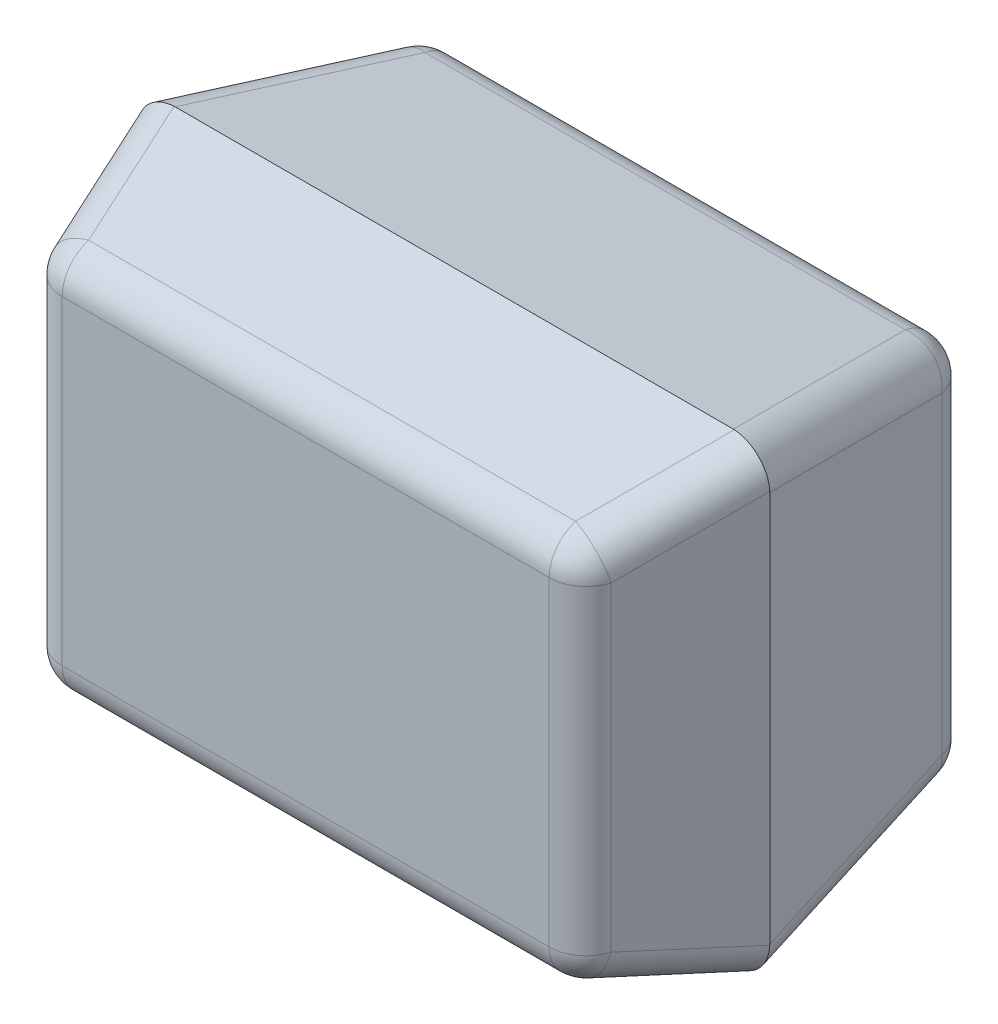
ISO-10303-21;
HEADER;
FILE_DESCRIPTION(('STEP AP214'),'2;1');
FILE_NAME('part.step','',(''),(''),'','','');
FILE_SCHEMA(('AUTOMOTIVE_DESIGN { 1 0 10303 214 1 1 1 1 }'));
ENDSEC;
DATA;
#1=APPLICATION_CONTEXT('core data for automotive mechanical design processes');
#2=APPLICATION_PROTOCOL_DEFINITION('international standard','automotive_design',2000,#1);
#3=PRODUCT_CONTEXT('',#1,'mechanical');
#4=PRODUCT('Part','Part','',(#3));
#5=PRODUCT_RELATED_PRODUCT_CATEGORY('part','',(#4));
#6=PRODUCT_DEFINITION_FORMATION('','',#4);
#7=PRODUCT_DEFINITION_CONTEXT('part definition',#1,'design');
#8=PRODUCT_DEFINITION('design','',#6,#7);
#9=PRODUCT_DEFINITION_SHAPE('','',#8);
#10=(LENGTH_UNIT() NAMED_UNIT(*) SI_UNIT(.MILLI.,.METRE.));
#11=(NAMED_UNIT(*) PLANE_ANGLE_UNIT() SI_UNIT($,.RADIAN.));
#12=(NAMED_UNIT(*) SI_UNIT($,.STERADIAN.) SOLID_ANGLE_UNIT());
#13=UNCERTAINTY_MEASURE_WITH_UNIT(LENGTH_MEASURE(1.E-05),#10,'distance_accuracy_value','');
#14=(GEOMETRIC_REPRESENTATION_CONTEXT(3) GLOBAL_UNCERTAINTY_ASSIGNED_CONTEXT((#13)) GLOBAL_UNIT_ASSIGNED_CONTEXT((#10,
#11,#12)) REPRESENTATION_CONTEXT('',''));
#15=CARTESIAN_POINT('',(0.,0.,0.));
#16=DIRECTION('',(0.,0.,1.));
#17=DIRECTION('',(1.,0.,0.));
#18=AXIS2_PLACEMENT_3D('',#15,#16,#17);
#19=CARTESIAN_POINT('',(0.,0.,0.));
#20=DIRECTION('',(0.,0.,1.));
#21=DIRECTION('',(1.,0.,0.));
#22=AXIS2_PLACEMENT_3D('',#19,#20,#21);
#23=PLANE('',#22);
#24=DIRECTION('',(0.,-1.,0.));
#25=VECTOR('',#24,1.);
#26=CARTESIAN_POINT('',(-0.646771674648,0.15625,0.));
#27=LINE('',#26,#25);
#28=CARTESIAN_POINT('',(-0.646771674648,0.421771674648,0.));
#29=VERTEX_POINT('',#28);
#30=CARTESIAN_POINT('',(-0.646771674648,-0.421771674648,0.));
#31=VERTEX_POINT('',#30);
#32=EDGE_CURVE('E265',#29,#31,#27,.T.);
#33=ORIENTED_EDGE('',*,*,#32,.F.);
#34=DIRECTION('',(-1.,0.,0.));
#35=VECTOR('',#34,1.);
#36=CARTESIAN_POINT('',(0.2125,0.421771674648,0.));
#37=LINE('',#36,#35);
#38=CARTESIAN_POINT('',(0.646771674648,0.421771674648,0.));
#39=VERTEX_POINT('',#38);
#40=EDGE_CURVE('E173',#39,#29,#37,.T.);
#41=ORIENTED_EDGE('',*,*,#40,.F.);
#42=DIRECTION('',(0.,1.,0.));
#43=VECTOR('',#42,1.);
#44=CARTESIAN_POINT('',(0.646771674648,-0.15625,0.));
#45=LINE('',#44,#43);
#46=CARTESIAN_POINT('',(0.646771674648,-0.421771674648,0.));
#47=VERTEX_POINT('',#46);
#48=EDGE_CURVE('E255',#47,#39,#45,.T.);
#49=ORIENTED_EDGE('',*,*,#48,.F.);
#50=DIRECTION('',(1.,0.,0.));
#51=VECTOR('',#50,1.);
#52=CARTESIAN_POINT('',(-0.2125,-0.421771674648,0.));
#53=LINE('',#52,#51);
#54=EDGE_CURVE('E261',#31,#47,#53,.T.);
#55=ORIENTED_EDGE('',*,*,#54,.F.);
#56=EDGE_LOOP('',(#33,#41,#49,#55));
#57=FACE_BOUND('',#56,.T.);
#58=ADVANCED_FACE('F17',(#57),#23,.F.);
#59=CARTESIAN_POINT('',(0.2125,0.421771674648,0.1));
#60=DIRECTION('',(-1.,0.,0.));
#61=DIRECTION('',(0.,-1.,0.));
#62=AXIS2_PLACEMENT_3D('',#59,#60,#61);
#63=CYLINDRICAL_SURFACE('',#62,0.1);
#64=CARTESIAN_POINT('',(0.646771674648,0.421771674648,0.1));
#65=DIRECTION('',(-1.,0.,0.));
#66=DIRECTION('',(0.,-1.,0.));
#67=AXIS2_PLACEMENT_3D('',#64,#65,#66);
#68=CIRCLE('',#67,0.1);
#69=CARTESIAN_POINT('',(0.646771674648,0.520109892686856,0.0818452520544166));
#70=VERTEX_POINT('',#69);
#71=EDGE_CURVE('E258',#39,#70,#68,.F.);
#72=ORIENTED_EDGE('',*,*,#71,.F.);
#73=ORIENTED_EDGE('',*,*,#40,.T.);
#74=CARTESIAN_POINT('',(-0.646771674648,0.421771674648,0.1));
#75=DIRECTION('',(-1.,0.,0.));
#76=DIRECTION('',(0.,-1.,0.));
#77=AXIS2_PLACEMENT_3D('',#74,#75,#76);
#78=CIRCLE('',#77,0.1);
#79=CARTESIAN_POINT('',(-0.646771674648072,0.52010989268686,0.0818452520544024));
#80=VERTEX_POINT('',#79);
#81=EDGE_CURVE('E20',#80,#29,#78,.T.);
#82=ORIENTED_EDGE('',*,*,#81,.F.);
#83=DIRECTION('',(1.,0.,0.));
#84=VECTOR('',#83,1.);
#85=CARTESIAN_POINT('',(0.425,0.52010989268698,0.0818452520543936));
#86=LINE('',#85,#84);
#87=EDGE_CURVE('E201',#70,#80,#86,.F.);
#88=ORIENTED_EDGE('',*,*,#87,.F.);
#89=EDGE_LOOP('',(#72,#73,#82,#88));
#90=FACE_BOUND('',#89,.T.);
#91=ADVANCED_FACE('F180',(#90),#63,.T.);
#92=CARTESIAN_POINT('',(-0.646771674648,0.421771674648,0.1));
#93=DIRECTION('',(-0.50498901887366,0.504989018873718,-0.699980129456528));
#94=DIRECTION('',(0.810982774092943,2.52992071736458E-13,-0.58507003010282));
#95=AXIS2_PLACEMENT_3D('',#92,#93,#94);
#96=SPHERICAL_SURFACE('',#95,0.1);
#97=CARTESIAN_POINT('',(-0.697270576535366,0.472270576535372,0.0300019870543472));
#98=VERTEX_POINT('',#97);
#99=VERTEX_LOOP('',#98);
#100=FACE_BOUND('',#99,.T.);
#101=CARTESIAN_POINT('',(-0.646771674648016,0.421771674648016,0.100000000000013));
#102=DIRECTION('',(0.178627606623071,-0.178627606623071,-0.967566202543385));
#103=DIRECTION('',(-0.983382180387285,0.,-0.181547479455786));
#104=AXIS2_PLACEMENT_3D('',#101,#102,#103);
#105=CIRCLE('',#104,0.1);
#106=CARTESIAN_POINT('',(-0.745109892686856,0.421771674648,0.0818452520544165));
#107=VERTEX_POINT('',#106);
#108=EDGE_CURVE('E184',#80,#107,#105,.F.);
#109=ORIENTED_EDGE('',*,*,#108,.F.);
#110=ORIENTED_EDGE('',*,*,#81,.T.);
#111=CARTESIAN_POINT('',(-0.646771674648,0.421771674648,0.1));
#112=DIRECTION('',(0.,-1.,0.));
#113=DIRECTION('',(1.,0.,0.));
#114=AXIS2_PLACEMENT_3D('',#111,#112,#113);
#115=CIRCLE('',#114,0.1);
#116=EDGE_CURVE('E188',#107,#29,#115,.T.);
#117=ORIENTED_EDGE('',*,*,#116,.F.);
#118=EDGE_LOOP('',(#109,#110,#117));
#119=FACE_BOUND('',#118,.T.);
#120=ADVANCED_FACE('F176',(#100,#119),#96,.T.);
#121=CARTESIAN_POINT('',(-0.646771674648,0.15625,0.1));
#122=DIRECTION('',(0.,-1.,0.));
#123=DIRECTION('',(1.,0.,0.));
#124=AXIS2_PLACEMENT_3D('',#121,#122,#123);
#125=CYLINDRICAL_SURFACE('',#124,0.1);
#126=ORIENTED_EDGE('',*,*,#116,.T.);
#127=ORIENTED_EDGE('',*,*,#32,.T.);
#128=CARTESIAN_POINT('',(-0.646771674648,-0.421771674648,0.1));
#129=DIRECTION('',(0.,-1.,0.));
#130=DIRECTION('',(1.,0.,0.));
#131=AXIS2_PLACEMENT_3D('',#128,#129,#130);
#132=CIRCLE('',#131,0.1);
#133=CARTESIAN_POINT('',(-0.745109892686856,-0.421771674648,0.0818452520544165));
#134=VERTEX_POINT('',#133);
#135=EDGE_CURVE('E267',#134,#31,#132,.T.);
#136=ORIENTED_EDGE('',*,*,#135,.F.);
#137=DIRECTION('',(0.,1.,0.));
#138=VECTOR('',#137,1.);
#139=CARTESIAN_POINT('',(-0.74510989268698,0.3125,0.0818452520543936));
#140=LINE('',#139,#138);
#141=EDGE_CURVE('E246',#107,#134,#140,.F.);
#142=ORIENTED_EDGE('',*,*,#141,.F.);
#143=EDGE_LOOP('',(#126,#127,#136,#142));
#144=FACE_BOUND('',#143,.T.);
#145=ADVANCED_FACE('F179',(#144),#125,.T.);
#146=CARTESIAN_POINT('',(-0.646771674648,-0.421771674648,0.1));
#147=DIRECTION('',(-0.50498901887366,-0.504989018873718,-0.699980129456528));
#148=DIRECTION('',(0.810982774092943,-2.52992071736458E-13,-0.58507003010282));
#149=AXIS2_PLACEMENT_3D('',#146,#147,#148);
#150=SPHERICAL_SURFACE('',#149,0.1);
#151=CARTESIAN_POINT('',(-0.697270576535366,-0.472270576535372,0.0300019870543472));
#152=VERTEX_POINT('',#151);
#153=VERTEX_LOOP('',#152);
#154=FACE_BOUND('',#153,.T.);
#155=CARTESIAN_POINT('',(-0.646771674648,-0.421771674648,0.1));
#156=DIRECTION('',(1.,0.,0.));
#157=DIRECTION('',(0.,1.,0.));
#158=AXIS2_PLACEMENT_3D('',#155,#156,#157);
#159=CIRCLE('',#158,0.1);
#160=CARTESIAN_POINT('',(-0.646771674648,-0.520109892686856,0.0818452520544166));
#161=VERTEX_POINT('',#160);
#162=EDGE_CURVE('E264',#161,#31,#159,.T.);
#163=ORIENTED_EDGE('',*,*,#162,.F.);
#164=CARTESIAN_POINT('',(-0.646771674648051,-0.421771674648051,0.0999999999999998));
#165=DIRECTION('',(-0.178627606623071,-0.178627606623071,0.967566202543385));
#166=DIRECTION('',(0.983382180387285,0.,0.181547479455786));
#167=AXIS2_PLACEMENT_3D('',#164,#165,#166);
#168=CIRCLE('',#167,0.1);
#169=EDGE_CURVE('E358',#134,#161,#168,.T.);
#170=ORIENTED_EDGE('',*,*,#169,.F.);
#171=ORIENTED_EDGE('',*,*,#135,.T.);
#172=EDGE_LOOP('',(#163,#170,#171));
#173=FACE_BOUND('',#172,.T.);
#174=ADVANCED_FACE('F248',(#154,#173),#150,.T.);
#175=CARTESIAN_POINT('',(-0.2125,-0.421771674648,0.1));
#176=DIRECTION('',(1.,0.,0.));
#177=DIRECTION('',(0.,1.,0.));
#178=AXIS2_PLACEMENT_3D('',#175,#176,#177);
#179=CYLINDRICAL_SURFACE('',#178,0.1);
#180=ORIENTED_EDGE('',*,*,#162,.T.);
#181=ORIENTED_EDGE('',*,*,#54,.T.);
#182=CARTESIAN_POINT('',(0.646771674648,-0.421771674648,0.1));
#183=DIRECTION('',(1.,0.,0.));
#184=DIRECTION('',(0.,1.,0.));
#185=AXIS2_PLACEMENT_3D('',#182,#183,#184);
#186=CIRCLE('',#185,0.1);
#187=CARTESIAN_POINT('',(0.646771674648072,-0.52010989268686,0.0818452520544024));
#188=VERTEX_POINT('',#187);
#189=EDGE_CURVE('E263',#188,#47,#186,.T.);
#190=ORIENTED_EDGE('',*,*,#189,.F.);
#191=DIRECTION('',(1.,0.,0.));
#192=VECTOR('',#191,1.);
#193=CARTESIAN_POINT('',(-0.425,-0.52010989268698,0.0818452520543936));
#194=LINE('',#193,#192);
#195=EDGE_CURVE('E239',#161,#188,#194,.T.);
#196=ORIENTED_EDGE('',*,*,#195,.F.);
#197=EDGE_LOOP('',(#180,#181,#190,#196));
#198=FACE_BOUND('',#197,.T.);
#199=ADVANCED_FACE('F234',(#198),#179,.T.);
#200=CARTESIAN_POINT('',(0.646771674648,-0.421771674648,0.1));
#201=DIRECTION('',(0.50498901887366,-0.504989018873718,-0.699980129456528));
#202=DIRECTION('',(0.810982774092943,2.52992071736458E-13,0.58507003010282));
#203=AXIS2_PLACEMENT_3D('',#200,#201,#202);
#204=SPHERICAL_SURFACE('',#203,0.1);
#205=CARTESIAN_POINT('',(0.697270576535366,-0.472270576535372,0.0300019870543472));
#206=VERTEX_POINT('',#205);
#207=VERTEX_LOOP('',#206);
#208=FACE_BOUND('',#207,.T.);
#209=CARTESIAN_POINT('',(0.646771674648016,-0.421771674648016,0.100000000000013));
#210=DIRECTION('',(-0.178627606623071,0.178627606623071,-0.967566202543385));
#211=DIRECTION('',(-0.983382180387285,0.,0.181547479455786));
#212=AXIS2_PLACEMENT_3D('',#209,#210,#211);
#213=CIRCLE('',#212,0.1);
#214=CARTESIAN_POINT('',(0.745109892686856,-0.421771674648,0.0818452520544165));
#215=VERTEX_POINT('',#214);
#216=EDGE_CURVE('E351',#188,#215,#213,.F.);
#217=ORIENTED_EDGE('',*,*,#216,.F.);
#218=ORIENTED_EDGE('',*,*,#189,.T.);
#219=CARTESIAN_POINT('',(0.646771674648,-0.421771674648,0.1));
#220=DIRECTION('',(0.,1.,0.));
#221=DIRECTION('',(-1.,0.,0.));
#222=AXIS2_PLACEMENT_3D('',#219,#220,#221);
#223=CIRCLE('',#222,0.1);
#224=EDGE_CURVE('E259',#215,#47,#223,.T.);
#225=ORIENTED_EDGE('',*,*,#224,.F.);
#226=EDGE_LOOP('',(#217,#218,#225));
#227=FACE_BOUND('',#226,.T.);
#228=ADVANCED_FACE('F230',(#208,#227),#204,.T.);
#229=CARTESIAN_POINT('',(0.646771674648,-0.15625,0.1));
#230=DIRECTION('',(0.,1.,0.));
#231=DIRECTION('',(-1.,0.,0.));
#232=AXIS2_PLACEMENT_3D('',#229,#230,#231);
#233=CYLINDRICAL_SURFACE('',#232,0.1);
#234=ORIENTED_EDGE('',*,*,#224,.T.);
#235=ORIENTED_EDGE('',*,*,#48,.T.);
#236=CARTESIAN_POINT('',(0.646771674648,0.421771674648,0.1));
#237=DIRECTION('',(0.,1.,0.));
#238=DIRECTION('',(-1.,0.,0.));
#239=AXIS2_PLACEMENT_3D('',#236,#237,#238);
#240=CIRCLE('',#239,0.1);
#241=CARTESIAN_POINT('',(0.745109892686856,0.421771674648,0.0818452520544166));
#242=VERTEX_POINT('',#241);
#243=EDGE_CURVE('E203',#242,#39,#240,.T.);
#244=ORIENTED_EDGE('',*,*,#243,.F.);
#245=DIRECTION('',(0.,1.,0.));
#246=VECTOR('',#245,1.);
#247=CARTESIAN_POINT('',(0.74510989268698,-0.3125,0.0818452520543936));
#248=LINE('',#247,#246);
#249=EDGE_CURVE('E218',#215,#242,#248,.T.);
#250=ORIENTED_EDGE('',*,*,#249,.F.);
#251=EDGE_LOOP('',(#234,#235,#244,#250));
#252=FACE_BOUND('',#251,.T.);
#253=ADVANCED_FACE('F226',(#252),#233,.T.);
#254=CARTESIAN_POINT('',(0.646771674648,0.421771674648,0.1));
#255=DIRECTION('',(0.50498901887366,0.504989018873718,-0.699980129456528));
#256=DIRECTION('',(0.810982774092943,-2.52992071736458E-13,0.58507003010282));
#257=AXIS2_PLACEMENT_3D('',#254,#255,#256);
#258=SPHERICAL_SURFACE('',#257,0.1);
#259=CARTESIAN_POINT('',(0.697270576535366,0.472270576535372,0.0300019870543472));
#260=VERTEX_POINT('',#259);
#261=VERTEX_LOOP('',#260);
#262=FACE_BOUND('',#261,.T.);
#263=CARTESIAN_POINT('',(0.646771674648051,0.421771674648051,0.0999999999999998));
#264=DIRECTION('',(-0.178627606623071,-0.178627606623071,-0.967566202543385));
#265=DIRECTION('',(-0.983382180387285,0.,0.181547479455786));
#266=AXIS2_PLACEMENT_3D('',#263,#264,#265);
#267=CIRCLE('',#266,0.1);
#268=EDGE_CURVE('E214',#242,#70,#267,.F.);
#269=ORIENTED_EDGE('',*,*,#268,.F.);
#270=ORIENTED_EDGE('',*,*,#243,.T.);
#271=ORIENTED_EDGE('',*,*,#71,.T.);
#272=EDGE_LOOP('',(#269,#270,#271));
#273=FACE_BOUND('',#272,.T.);
#274=ADVANCED_FACE('F221',(#262,#273),#258,.T.);
#275=CARTESIAN_POINT('',(0.425,0.565,0.325));
#276=DIRECTION('',(0.,0.983382180387238,-0.181547479456044));
#277=DIRECTION('',(0.,0.181547479456044,0.983382180387238));
#278=AXIS2_PLACEMENT_3D('',#275,#276,#277);
#279=PLANE('',#278);
#280=DIRECTION('',(0.178627606623071,-0.178627606623071,-0.967566202543385));
#281=VECTOR('',#280,1.);
#282=CARTESIAN_POINT('',(-0.671387176022128,0.544725394060724,0.215179217830399));
#283=LINE('',#282,#281);
#284=CARTESIAN_POINT('',(-0.751661781961058,0.624999999999742,0.650000000000373));
#285=VERTEX_POINT('',#284);
#286=EDGE_CURVE('E192',#285,#80,#283,.T.);
#287=ORIENTED_EDGE('',*,*,#286,.F.);
#288=DIRECTION('',(1.,0.,0.));
#289=VECTOR('',#288,1.);
#290=CARTESIAN_POINT('',(0.425,0.624999999999942,0.649999999999983));
#291=LINE('',#290,#289);
#292=CARTESIAN_POINT('',(0.751661781960929,0.624999999999763,0.650000000000334));
#293=VERTEX_POINT('',#292);
#294=EDGE_CURVE('E209',#293,#285,#291,.F.);
#295=ORIENTED_EDGE('',*,*,#294,.F.);
#296=DIRECTION('',(-0.178627606623071,-0.178627606623071,-0.967566202543385));
#297=VECTOR('',#296,1.);
#298=CARTESIAN_POINT('',(0.674976805979949,0.54831502401873,0.23462304676943));
#299=LINE('',#298,#297);
#300=EDGE_CURVE('E212',#70,#293,#299,.F.);
#301=ORIENTED_EDGE('',*,*,#300,.F.);
#302=ORIENTED_EDGE('',*,*,#87,.T.);
#303=EDGE_LOOP('',(#287,#295,#301,#302));
#304=FACE_BOUND('',#303,.T.);
#305=ADVANCED_FACE('F225',(#304),#279,.T.);
#306=CARTESIAN_POINT('',(-0.645558843145,0.420558843145,0.983460305887));
#307=DIRECTION('',(-0.276172385369158,0.276172385369158,-0.920574617898527));
#308=DIRECTION('',(-0.957826285221266,0.,0.287347885565964));
#309=AXIS2_PLACEMENT_3D('',#306,#307,#308);
#310=CYLINDRICAL_SURFACE('',#309,0.1);
#311=DIRECTION('',(0.276172385370209,-0.276172385369174,0.920574617898207));
#312=VECTOR('',#311,1.);
#313=CARTESIAN_POINT('',(-0.754197937677,0.624980566198575,0.650064779337873));
#314=LINE('',#313,#312);
#315=CARTESIAN_POINT('',(-0.754197937676618,0.624980566198469,0.65006477933832));
#316=VERTEX_POINT('',#315);
#317=CARTESIAN_POINT('',(-0.655596934911,0.526379563433014,0.978734788557004));
#318=VERTEX_POINT('',#317);
#319=EDGE_CURVE('E340',#316,#318,#314,.T.);
#320=ORIENTED_EDGE('',*,*,#319,.F.);
#321=CARTESIAN_POINT('',(-0.747276535700449,0.522276535700449,0.644401330701678));
#322=DIRECTION('',(-0.0515244805270769,0.0515244805270769,-0.997341694612649));
#323=DIRECTION('',(0.705227075420687,-0.705227075420687,-0.0728666191556206));
#324=AXIS2_PLACEMENT_3D('',#321,#322,#323);
#325=ELLIPSE('',#324,0.105642723658633,0.1);
#326=CARTESIAN_POINT('',(-0.849980566198469,0.529197937676618,0.65006477933832));
#327=VERTEX_POINT('',#326);
#328=EDGE_CURVE('E191',#327,#316,#325,.T.);
#329=ORIENTED_EDGE('',*,*,#328,.F.);
#330=DIRECTION('',(-0.276172385369174,0.276172385370209,-0.920574617898207));
#331=VECTOR('',#330,1.);
#332=CARTESIAN_POINT('',(-0.751379563432945,0.430596934911,0.978734788556984));
#333=LINE('',#332,#331);
#334=CARTESIAN_POINT('',(-0.751379563433016,0.43059693491098,0.978734788556999));
#335=VERTEX_POINT('',#334);
#336=EDGE_CURVE('E326',#335,#327,#333,.T.);
#337=ORIENTED_EDGE('',*,*,#336,.F.);
#338=CARTESIAN_POINT('',(-0.65559693491096,0.43059693491096,0.950000000000418));
#339=DIRECTION('',(-0.276172385369158,0.276172385369158,-0.920574617898527));
#340=DIRECTION('',(-0.957826285221266,0.,0.287347885565964));
#341=AXIS2_PLACEMENT_3D('',#338,#339,#340);
#342=CIRCLE('',#341,0.1);
#343=EDGE_CURVE('E335',#318,#335,#342,.F.);
#344=ORIENTED_EDGE('',*,*,#343,.F.);
#345=EDGE_LOOP('',(#320,#329,#337,#344));
#346=FACE_BOUND('',#345,.T.);
#347=ADVANCED_FACE('F452',(#346),#310,.T.);
#348=CARTESIAN_POINT('',(-0.671387176022,0.446387176022,0.233333965776));
#349=DIRECTION('',(0.178627606623071,-0.178627606623071,-0.967566202543385));
#350=DIRECTION('',(-0.983382180387285,0.,-0.181547479455786));
#351=AXIS2_PLACEMENT_3D('',#348,#349,#350);
#352=CYLINDRICAL_SURFACE('',#351,0.1);
#353=ORIENTED_EDGE('',*,*,#328,.T.);
#354=CARTESIAN_POINT('',(-0.787049131924805,0.562049131924805,0.859836226917326));
#355=DIRECTION('',(0.,0.957826285221234,0.28734788556607));
#356=DIRECTION('',(0.199925627641135,0.281546640760993,-0.938488802537622));
#357=AXIS2_PLACEMENT_3D('',#354,#355,#356);
#358=ELLIPSE('',#357,0.222656491772431,0.1);
#359=EDGE_CURVE('E197',#285,#316,#358,.T.);
#360=ORIENTED_EDGE('',*,*,#359,.F.);
#361=ORIENTED_EDGE('',*,*,#286,.T.);
#362=ORIENTED_EDGE('',*,*,#108,.T.);
#363=DIRECTION('',(0.178627606623317,-0.178627606623317,-0.967566202543294));
#364=VECTOR('',#363,1.);
#365=CARTESIAN_POINT('',(-0.84999999999998,0.526661781961,0.650000000000004));
#366=LINE('',#365,#364);
#367=CARTESIAN_POINT('',(-0.849999999999841,0.526661781960986,0.650000000000322));
#368=VERTEX_POINT('',#367);
#369=EDGE_CURVE('E361',#368,#107,#366,.T.);
#370=ORIENTED_EDGE('',*,*,#369,.F.);
#371=CARTESIAN_POINT('',(-0.787049131924805,0.562049131924805,0.859836226917327));
#372=DIRECTION('',(-0.957826285221234,0.,0.28734788556607));
#373=DIRECTION('',(-0.281546640760993,-0.199925627641135,-0.938488802537622));
#374=AXIS2_PLACEMENT_3D('',#371,#372,#373);
#375=ELLIPSE('',#374,0.222656491772431,0.1);
#376=EDGE_CURVE('E323',#327,#368,#375,.T.);
#377=ORIENTED_EDGE('',*,*,#376,.F.);
#378=EDGE_LOOP('',(#353,#360,#361,#362,#370,#377));
#379=FACE_BOUND('',#378,.T.);
#380=ADVANCED_FACE('F195',(#379),#352,.T.);
#381=CARTESIAN_POINT('',(-0.79,0.3125,0.325));
#382=DIRECTION('',(-0.983382180387238,0.,-0.181547479456044));
#383=DIRECTION('',(-0.181547479456044,0.,0.983382180387238));
#384=AXIS2_PLACEMENT_3D('',#381,#382,#383);
#385=PLANE('',#384);
#386=ORIENTED_EDGE('',*,*,#369,.T.);
#387=ORIENTED_EDGE('',*,*,#141,.T.);
#388=DIRECTION('',(-0.178627606623071,-0.178627606623071,0.967566202543385));
#389=VECTOR('',#388,1.);
#390=CARTESIAN_POINT('',(-0.773315024018725,-0.449976805980093,0.234623046769405));
#391=LINE('',#390,#389);
#392=CARTESIAN_POINT('',(-0.849999999999763,-0.526661781961052,0.650000000000334));
#393=VERTEX_POINT('',#392);
#394=EDGE_CURVE('E207',#393,#134,#391,.F.);
#395=ORIENTED_EDGE('',*,*,#394,.F.);
#396=DIRECTION('',(0.,1.,0.));
#397=VECTOR('',#396,1.);
#398=CARTESIAN_POINT('',(-0.849999999999942,0.3125,0.649999999999983));
#399=LINE('',#398,#397);
#400=EDGE_CURVE('E322',#368,#393,#399,.F.);
#401=ORIENTED_EDGE('',*,*,#400,.F.);
#402=EDGE_LOOP('',(#386,#387,#395,#401));
#403=FACE_BOUND('',#402,.T.);
#404=ADVANCED_FACE('F379',(#403),#385,.T.);
#405=CARTESIAN_POINT('',(-0.67497680598,-0.44997680598,0.252777794715));
#406=DIRECTION('',(-0.178627606623071,-0.178627606623071,0.967566202543385));
#407=DIRECTION('',(0.983382180387285,0.,0.181547479455786));
#408=AXIS2_PLACEMENT_3D('',#405,#406,#407);
#409=CYLINDRICAL_SURFACE('',#408,0.1);
#410=CARTESIAN_POINT('',(-0.747276535700287,-0.522276535700287,0.644401330700595));
#411=DIRECTION('',(-0.0515244805270769,-0.0515244805270769,-0.997341694612649));
#412=DIRECTION('',(-0.705227075420687,-0.705227075420687,0.0728666191556206));
#413=AXIS2_PLACEMENT_3D('',#410,#411,#412);
#414=ELLIPSE('',#413,0.105642723658633,0.1);
#415=CARTESIAN_POINT('',(-0.849980566198557,-0.529197937676706,0.650064779337623));
#416=VERTEX_POINT('',#415);
#417=CARTESIAN_POINT('',(-0.754197937676706,-0.624980566198556,0.650064779337623));
#418=VERTEX_POINT('',#417);
#419=EDGE_CURVE('E242',#416,#418,#414,.F.);
#420=ORIENTED_EDGE('',*,*,#419,.F.);
#421=CARTESIAN_POINT('',(-0.787049131924828,-0.562049131924828,0.85983622691725));
#422=DIRECTION('',(-0.957826285221234,0.,0.28734788556607));
#423=DIRECTION('',(0.281546640760993,-0.199925627641136,0.938488802537622));
#424=AXIS2_PLACEMENT_3D('',#421,#422,#423);
#425=ELLIPSE('',#424,0.222656491772431,0.1);
#426=EDGE_CURVE('E332',#393,#416,#425,.T.);
#427=ORIENTED_EDGE('',*,*,#426,.F.);
#428=ORIENTED_EDGE('',*,*,#394,.T.);
#429=ORIENTED_EDGE('',*,*,#169,.T.);
#430=DIRECTION('',(0.178627606623317,0.178627606623317,-0.967566202543294));
#431=VECTOR('',#430,1.);
#432=CARTESIAN_POINT('',(-0.751661781961,-0.62499999999998,0.650000000000004));
#433=LINE('',#432,#431);
#434=CARTESIAN_POINT('',(-0.751661781960998,-0.624999999999852,0.650000000000284));
#435=VERTEX_POINT('',#434);
#436=EDGE_CURVE('E243',#435,#161,#433,.T.);
#437=ORIENTED_EDGE('',*,*,#436,.F.);
#438=CARTESIAN_POINT('',(-0.787049131924828,-0.562049131924828,0.85983622691725));
#439=DIRECTION('',(0.,-0.957826285221234,0.28734788556607));
#440=DIRECTION('',(-0.199925627641136,0.281546640760993,0.938488802537622));
#441=AXIS2_PLACEMENT_3D('',#438,#439,#440);
#442=ELLIPSE('',#441,0.222656491772431,0.1);
#443=EDGE_CURVE('E316',#418,#435,#442,.T.);
#444=ORIENTED_EDGE('',*,*,#443,.F.);
#445=EDGE_LOOP('',(#420,#427,#428,#429,#437,#444));
#446=FACE_BOUND('',#445,.T.);
#447=ADVANCED_FACE('F444',(#446),#409,.T.);
#448=CARTESIAN_POINT('',(-0.425,-0.565,0.325));
#449=DIRECTION('',(0.,-0.983382180387238,-0.181547479456044));
#450=DIRECTION('',(0.,0.181547479456044,-0.983382180387238));
#451=AXIS2_PLACEMENT_3D('',#448,#449,#450);
#452=PLANE('',#451);
#453=DIRECTION('',(-0.178627606623071,0.178627606623071,-0.967566202543385));
#454=VECTOR('',#453,1.);
#455=CARTESIAN_POINT('',(0.671387176022128,-0.544725394060724,0.215179217830399));
#456=LINE('',#455,#454);
#457=CARTESIAN_POINT('',(0.751661781961058,-0.624999999999742,0.650000000000374));
#458=VERTEX_POINT('',#457);
#459=EDGE_CURVE('E355',#458,#188,#456,.T.);
#460=ORIENTED_EDGE('',*,*,#459,.F.);
#461=DIRECTION('',(1.,0.,0.));
#462=VECTOR('',#461,1.);
#463=CARTESIAN_POINT('',(-0.425,-0.624999999999942,0.649999999999983));
#464=LINE('',#463,#462);
#465=EDGE_CURVE('E315',#435,#458,#464,.T.);
#466=ORIENTED_EDGE('',*,*,#465,.F.);
#467=ORIENTED_EDGE('',*,*,#436,.T.);
#468=ORIENTED_EDGE('',*,*,#195,.T.);
#469=EDGE_LOOP('',(#460,#466,#467,#468));
#470=FACE_BOUND('',#469,.T.);
#471=ADVANCED_FACE('F440',(#470),#452,.T.);
#472=CARTESIAN_POINT('',(-0.654139351619,-0.429139351619,0.954858610972));
#473=DIRECTION('',(-0.276172385369158,-0.276172385369158,-0.920574617898527));
#474=DIRECTION('',(-0.957826285221266,0.,0.287347885565964));
#475=AXIS2_PLACEMENT_3D('',#472,#473,#474);
#476=CYLINDRICAL_SURFACE('',#475,0.1);
#477=DIRECTION('',(0.276172385369174,0.276172385370209,0.920574617898207));
#478=VECTOR('',#477,1.);
#479=CARTESIAN_POINT('',(-0.849980566198576,-0.529197937677,0.650064779337873));
#480=LINE('',#479,#478);
#481=CARTESIAN_POINT('',(-0.751379563432839,-0.430596934910773,0.978734788556884));
#482=VERTEX_POINT('',#481);
#483=EDGE_CURVE('E329',#416,#482,#480,.T.);
#484=ORIENTED_EDGE('',*,*,#483,.F.);
#485=ORIENTED_EDGE('',*,*,#419,.T.);
#486=DIRECTION('',(-0.276172385370209,-0.276172385369174,-0.920574617898207));
#487=VECTOR('',#486,1.);
#488=CARTESIAN_POINT('',(-0.655596934911,-0.526379563432945,0.978734788556984));
#489=LINE('',#488,#487);
#490=CARTESIAN_POINT('',(-0.655596934911188,-0.526379563432805,0.978734788556998));
#491=VERTEX_POINT('',#490);
#492=EDGE_CURVE('E310',#491,#418,#489,.T.);
#493=ORIENTED_EDGE('',*,*,#492,.F.);
#494=CARTESIAN_POINT('',(-0.655596934910547,-0.430596934910547,0.95000000000017));
#495=DIRECTION('',(-0.276172385369158,-0.276172385369158,-0.920574617898527));
#496=DIRECTION('',(-0.957826285221266,0.,0.287347885565964));
#497=AXIS2_PLACEMENT_3D('',#494,#495,#496);
#498=CIRCLE('',#497,0.1);
#499=EDGE_CURVE('E319',#482,#491,#498,.F.);
#500=ORIENTED_EDGE('',*,*,#499,.F.);
#501=EDGE_LOOP('',(#484,#485,#493,#500));
#502=FACE_BOUND('',#501,.T.);
#503=ADVANCED_FACE('F436',(#502),#476,.T.);
#504=CARTESIAN_POINT('',(0.671387176022,-0.446387176022,0.233333965776));
#505=DIRECTION('',(-0.178627606623071,0.178627606623071,-0.967566202543385));
#506=DIRECTION('',(-0.983382180387285,0.,0.181547479455786));
#507=AXIS2_PLACEMENT_3D('',#504,#505,#506);
#508=CYLINDRICAL_SURFACE('',#507,0.1);
#509=CARTESIAN_POINT('',(0.747276535700449,-0.522276535700449,0.644401330701678));
#510=DIRECTION('',(0.0515244805270769,-0.0515244805270769,-0.997341694612649));
#511=DIRECTION('',(0.705227075420687,-0.705227075420687,0.0728666191556206));
#512=AXIS2_PLACEMENT_3D('',#509,#510,#511);
#513=ELLIPSE('',#512,0.105642723658633,0.1);
#514=CARTESIAN_POINT('',(0.754197937676618,-0.624980566198469,0.65006477933832));
#515=VERTEX_POINT('',#514);
#516=CARTESIAN_POINT('',(0.849980566198469,-0.529197937676618,0.65006477933832));
#517=VERTEX_POINT('',#516);
#518=EDGE_CURVE('E213',#515,#517,#513,.F.);
#519=ORIENTED_EDGE('',*,*,#518,.F.);
#520=CARTESIAN_POINT('',(0.787049131924805,-0.562049131924805,0.859836226917326));
#521=DIRECTION('',(0.,-0.957826285221234,0.28734788556607));
#522=DIRECTION('',(-0.199925627641135,-0.281546640760993,-0.938488802537622));
#523=AXIS2_PLACEMENT_3D('',#520,#521,#522);
#524=ELLIPSE('',#523,0.222656491772431,0.1);
#525=EDGE_CURVE('E311',#458,#515,#524,.T.);
#526=ORIENTED_EDGE('',*,*,#525,.F.);
#527=ORIENTED_EDGE('',*,*,#459,.T.);
#528=ORIENTED_EDGE('',*,*,#216,.T.);
#529=DIRECTION('',(-0.178627606623317,0.178627606623317,-0.967566202543294));
#530=VECTOR('',#529,1.);
#531=CARTESIAN_POINT('',(0.84999999999998,-0.526661781961,0.650000000000004));
#532=LINE('',#531,#530);
#533=CARTESIAN_POINT('',(0.849999999999841,-0.526661781960986,0.650000000000323));
#534=VERTEX_POINT('',#533);
#535=EDGE_CURVE('E354',#534,#215,#532,.T.);
#536=ORIENTED_EDGE('',*,*,#535,.F.);
#537=CARTESIAN_POINT('',(0.787049131924805,-0.562049131924805,0.859836226917327));
#538=DIRECTION('',(0.957826285221234,0.,0.28734788556607));
#539=DIRECTION('',(0.281546640760993,0.199925627641136,-0.938488802537622));
#540=AXIS2_PLACEMENT_3D('',#537,#538,#539);
#541=ELLIPSE('',#540,0.222656491772431,0.1);
#542=EDGE_CURVE('E305',#517,#534,#541,.T.);
#543=ORIENTED_EDGE('',*,*,#542,.F.);
#544=EDGE_LOOP('',(#519,#526,#527,#528,#536,#543));
#545=FACE_BOUND('',#544,.T.);
#546=ADVANCED_FACE('F432',(#545),#508,.T.);
#547=CARTESIAN_POINT('',(0.79,-0.3125,0.325));
#548=DIRECTION('',(0.983382180387238,0.,-0.181547479456044));
#549=DIRECTION('',(-0.181547479456044,0.,-0.983382180387238));
#550=AXIS2_PLACEMENT_3D('',#547,#548,#549);
#551=PLANE('',#550);
#552=DIRECTION('',(-0.178627606623071,-0.178627606623071,-0.967566202543385));
#553=VECTOR('',#552,1.);
#554=CARTESIAN_POINT('',(0.773315024018725,0.449976805980093,0.234623046769405));
#555=LINE('',#554,#553);
#556=CARTESIAN_POINT('',(0.849999999999763,0.526661781961052,0.650000000000334));
#557=VERTEX_POINT('',#556);
#558=EDGE_CURVE('E350',#557,#242,#555,.T.);
#559=ORIENTED_EDGE('',*,*,#558,.F.);
#560=DIRECTION('',(0.,1.,0.));
#561=VECTOR('',#560,1.);
#562=CARTESIAN_POINT('',(0.849999999999942,-0.3125,0.649999999999983));
#563=LINE('',#562,#561);
#564=EDGE_CURVE('E304',#534,#557,#563,.T.);
#565=ORIENTED_EDGE('',*,*,#564,.F.);
#566=ORIENTED_EDGE('',*,*,#535,.T.);
#567=ORIENTED_EDGE('',*,*,#249,.T.);
#568=EDGE_LOOP('',(#559,#565,#566,#567));
#569=FACE_BOUND('',#568,.T.);
#570=ADVANCED_FACE('F428',(#569),#551,.T.);
#571=CARTESIAN_POINT('',(0.67497680598,0.44997680598,0.252777794715));
#572=DIRECTION('',(-0.178627606623071,-0.178627606623071,-0.967566202543385));
#573=DIRECTION('',(-0.983382180387285,0.,0.181547479455786));
#574=AXIS2_PLACEMENT_3D('',#571,#572,#573);
#575=CYLINDRICAL_SURFACE('',#574,0.1);
#576=CARTESIAN_POINT('',(0.747276535700287,0.522276535700287,0.644401330700595));
#577=DIRECTION('',(-0.0515244805270769,-0.0515244805270769,0.997341694612649));
#578=DIRECTION('',(-0.705227075420687,-0.705227075420687,-0.0728666191556206));
#579=AXIS2_PLACEMENT_3D('',#576,#577,#578);
#580=ELLIPSE('',#579,0.105642723658633,0.1);
#581=CARTESIAN_POINT('',(0.849980566198556,0.529197937676706,0.650064779337623));
#582=VERTEX_POINT('',#581);
#583=CARTESIAN_POINT('',(0.754197937676706,0.624980566198556,0.650064779337623));
#584=VERTEX_POINT('',#583);
#585=EDGE_CURVE('E343',#582,#584,#580,.T.);
#586=ORIENTED_EDGE('',*,*,#585,.F.);
#587=CARTESIAN_POINT('',(0.787049131924828,0.562049131924828,0.85983622691725));
#588=DIRECTION('',(0.957826285221234,0.,0.28734788556607));
#589=DIRECTION('',(0.281546640760993,-0.199925627641135,-0.938488802537622));
#590=AXIS2_PLACEMENT_3D('',#587,#588,#589);
#591=ELLIPSE('',#590,0.222656491772431,0.1);
#592=EDGE_CURVE('E301',#557,#582,#591,.T.);
#593=ORIENTED_EDGE('',*,*,#592,.F.);
#594=ORIENTED_EDGE('',*,*,#558,.T.);
#595=ORIENTED_EDGE('',*,*,#268,.T.);
#596=ORIENTED_EDGE('',*,*,#300,.T.);
#597=CARTESIAN_POINT('',(0.787049131924828,0.562049131924828,0.85983622691725));
#598=DIRECTION('',(0.,0.957826285221234,0.28734788556607));
#599=DIRECTION('',(-0.199925627641136,0.281546640760993,-0.938488802537622));
#600=AXIS2_PLACEMENT_3D('',#597,#598,#599);
#601=ELLIPSE('',#600,0.222656491772431,0.1);
#602=EDGE_CURVE('E211',#584,#293,#601,.T.);
#603=ORIENTED_EDGE('',*,*,#602,.F.);
#604=EDGE_LOOP('',(#586,#593,#594,#595,#596,#603));
#605=FACE_BOUND('',#604,.T.);
#606=ADVANCED_FACE('F424',(#605),#575,.T.);
#607=CARTESIAN_POINT('',(0.645558843145,-0.420558843145,0.983460305887));
#608=DIRECTION('',(0.276172385369158,-0.276172385369158,-0.920574617898527));
#609=DIRECTION('',(-0.957826285221266,0.,-0.287347885565964));
#610=AXIS2_PLACEMENT_3D('',#607,#608,#609);
#611=CYLINDRICAL_SURFACE('',#610,0.1);
#612=DIRECTION('',(-0.276172385370209,0.276172385369174,0.920574617898207));
#613=VECTOR('',#612,1.);
#614=CARTESIAN_POINT('',(0.754197937677,-0.624980566198575,0.650064779337873));
#615=LINE('',#614,#613);
#616=CARTESIAN_POINT('',(0.655596934911,-0.526379563433014,0.978734788557004));
#617=VERTEX_POINT('',#616);
#618=EDGE_CURVE('E314',#515,#617,#615,.T.);
#619=ORIENTED_EDGE('',*,*,#618,.F.);
#620=ORIENTED_EDGE('',*,*,#518,.T.);
#621=DIRECTION('',(0.276172385369174,-0.276172385370209,-0.920574617898207));
#622=VECTOR('',#621,1.);
#623=CARTESIAN_POINT('',(0.751379563432945,-0.430596934911,0.978734788556984));
#624=LINE('',#623,#622);
#625=CARTESIAN_POINT('',(0.751379563432999,-0.430596934911188,0.978734788557056));
#626=VERTEX_POINT('',#625);
#627=EDGE_CURVE('E297',#626,#517,#624,.T.);
#628=ORIENTED_EDGE('',*,*,#627,.F.);
#629=CARTESIAN_POINT('',(0.65559693491096,-0.43059693491096,0.950000000000418));
#630=DIRECTION('',(0.276172385369158,-0.276172385369158,-0.920574617898527));
#631=DIRECTION('',(-0.957826285221266,0.,-0.287347885565964));
#632=AXIS2_PLACEMENT_3D('',#629,#630,#631);
#633=CIRCLE('',#632,0.1);
#634=EDGE_CURVE('E308',#617,#626,#633,.F.);
#635=ORIENTED_EDGE('',*,*,#634,.F.);
#636=EDGE_LOOP('',(#619,#620,#628,#635));
#637=FACE_BOUND('',#636,.T.);
#638=ADVANCED_FACE('F420',(#637),#611,.T.);
#639=CARTESIAN_POINT('',(0.654139351619,0.429139351619,0.954858610972));
#640=DIRECTION('',(-0.276172385369158,-0.276172385369158,0.920574617898527));
#641=DIRECTION('',(0.957826285221266,0.,0.287347885565964));
#642=AXIS2_PLACEMENT_3D('',#639,#640,#641);
#643=CYLINDRICAL_SURFACE('',#642,0.1);
#644=DIRECTION('',(-0.276172385369174,-0.276172385370209,0.920574617898207));
#645=VECTOR('',#644,1.);
#646=CARTESIAN_POINT('',(0.849980566198575,0.529197937677,0.650064779337873));
#647=LINE('',#646,#645);
#648=CARTESIAN_POINT('',(0.751379563432839,0.430596934910773,0.978734788556884));
#649=VERTEX_POINT('',#648);
#650=EDGE_CURVE('E298',#582,#649,#647,.T.);
#651=ORIENTED_EDGE('',*,*,#650,.F.);
#652=ORIENTED_EDGE('',*,*,#585,.T.);
#653=DIRECTION('',(0.276172385370209,0.276172385369174,-0.920574617898207));
#654=VECTOR('',#653,1.);
#655=CARTESIAN_POINT('',(0.655596934911,0.526379563432945,0.978734788556984));
#656=LINE('',#655,#654);
#657=CARTESIAN_POINT('',(0.655596934911188,0.526379563432805,0.978734788556998));
#658=VERTEX_POINT('',#657);
#659=EDGE_CURVE('E338',#658,#584,#656,.T.);
#660=ORIENTED_EDGE('',*,*,#659,.F.);
#661=CARTESIAN_POINT('',(0.655596934910547,0.430596934910547,0.95000000000017));
#662=DIRECTION('',(-0.276172385369158,-0.276172385369158,0.920574617898527));
#663=DIRECTION('',(0.957826285221266,0.,0.287347885565964));
#664=AXIS2_PLACEMENT_3D('',#661,#662,#663);
#665=CIRCLE('',#664,0.1);
#666=EDGE_CURVE('E294',#649,#658,#665,.T.);
#667=ORIENTED_EDGE('',*,*,#666,.F.);
#668=EDGE_LOOP('',(#651,#652,#660,#667));
#669=FACE_BOUND('',#668,.T.);
#670=ADVANCED_FACE('F416',(#669),#643,.T.);
#671=CARTESIAN_POINT('',(0.425,0.565,0.85));
#672=DIRECTION('',(0.,0.957826285221234,0.28734788556607));
#673=DIRECTION('',(0.,-0.28734788556607,0.957826285221234));
#674=AXIS2_PLACEMENT_3D('',#671,#672,#673);
#675=PLANE('',#674);
#676=DIRECTION('',(1.,0.,0.));
#677=VECTOR('',#676,1.);
#678=CARTESIAN_POINT('',(0.2125,0.526379563433005,0.978734788557002));
#679=LINE('',#678,#677);
#680=EDGE_CURVE('E290',#658,#318,#679,.F.);
#681=ORIENTED_EDGE('',*,*,#680,.F.);
#682=ORIENTED_EDGE('',*,*,#659,.T.);
#683=ORIENTED_EDGE('',*,*,#602,.T.);
#684=ORIENTED_EDGE('',*,*,#294,.T.);
#685=ORIENTED_EDGE('',*,*,#359,.T.);
#686=ORIENTED_EDGE('',*,*,#319,.T.);
#687=EDGE_LOOP('',(#681,#682,#683,#684,#685,#686));
#688=FACE_BOUND('',#687,.T.);
#689=ADVANCED_FACE('F411',(#688),#675,.T.);
#690=CARTESIAN_POINT('',(-0.655596934911,0.430596934911,0.95));
#691=DIRECTION('',(-0.46112646385501,0.461126463854784,0.758106040515017));
#692=DIRECTION('',(-0.854363380853643,3.43614026121486E-13,-0.519676065887522));
#693=AXIS2_PLACEMENT_3D('',#690,#691,#692);
#694=SPHERICAL_SURFACE('',#693,0.1);
#695=CARTESIAN_POINT('',(-0.701709581296501,0.476709581296478,1.0258106040515));
#696=VERTEX_POINT('',#695);
#697=VERTEX_LOOP('',#696);
#698=FACE_BOUND('',#697,.T.);
#699=CARTESIAN_POINT('',(-0.655596934911,0.430596934911,0.95));
#700=DIRECTION('',(1.,0.,0.));
#701=DIRECTION('',(0.,1.,0.));
#702=AXIS2_PLACEMENT_3D('',#699,#700,#701);
#703=CIRCLE('',#702,0.1);
#704=CARTESIAN_POINT('',(-0.655596934911,0.430596934911,1.05));
#705=VERTEX_POINT('',#704);
#706=EDGE_CURVE('E287',#318,#705,#703,.T.);
#707=ORIENTED_EDGE('',*,*,#706,.F.);
#708=ORIENTED_EDGE('',*,*,#343,.T.);
#709=CARTESIAN_POINT('',(-0.655596934911,0.430596934911,0.95));
#710=DIRECTION('',(0.,1.,0.));
#711=DIRECTION('',(-1.,0.,0.));
#712=AXIS2_PLACEMENT_3D('',#709,#710,#711);
#713=CIRCLE('',#712,0.1);
#714=EDGE_CURVE('E284',#705,#335,#713,.F.);
#715=ORIENTED_EDGE('',*,*,#714,.F.);
#716=EDGE_LOOP('',(#707,#708,#715));
#717=FACE_BOUND('',#716,.T.);
#718=ADVANCED_FACE('F406',(#698,#717),#694,.T.);
#719=CARTESIAN_POINT('',(-0.79,0.3125,0.85));
#720=DIRECTION('',(-0.957826285221234,0.,0.28734788556607));
#721=DIRECTION('',(0.28734788556607,0.,0.957826285221234));
#722=AXIS2_PLACEMENT_3D('',#719,#720,#721);
#723=PLANE('',#722);
#724=ORIENTED_EDGE('',*,*,#376,.T.);
#725=ORIENTED_EDGE('',*,*,#400,.T.);
#726=ORIENTED_EDGE('',*,*,#426,.T.);
#727=ORIENTED_EDGE('',*,*,#483,.T.);
#728=DIRECTION('',(0.,1.,0.));
#729=VECTOR('',#728,1.);
#730=CARTESIAN_POINT('',(-0.751379563433005,0.15625,0.978734788557002));
#731=LINE('',#730,#729);
#732=EDGE_CURVE('E283',#335,#482,#731,.F.);
#733=ORIENTED_EDGE('',*,*,#732,.F.);
#734=ORIENTED_EDGE('',*,*,#336,.T.);
#735=EDGE_LOOP('',(#724,#725,#726,#727,#733,#734));
#736=FACE_BOUND('',#735,.T.);
#737=ADVANCED_FACE('F410',(#736),#723,.T.);
#738=CARTESIAN_POINT('',(-0.655596934911,-0.430596934911,0.95));
#739=DIRECTION('',(-0.46112646385501,-0.461126463854784,0.758106040515017));
#740=DIRECTION('',(-0.854363380853643,-3.43614026121486E-13,-0.519676065887522));
#741=AXIS2_PLACEMENT_3D('',#738,#739,#740);
#742=SPHERICAL_SURFACE('',#741,0.1);
#743=CARTESIAN_POINT('',(-0.701709581296501,-0.476709581296478,1.0258106040515));
#744=VERTEX_POINT('',#743);
#745=VERTEX_LOOP('',#744);
#746=FACE_BOUND('',#745,.T.);
#747=CARTESIAN_POINT('',(-0.655596934911,-0.430596934911,0.95));
#748=DIRECTION('',(0.,1.,0.));
#749=DIRECTION('',(-1.,0.,0.));
#750=AXIS2_PLACEMENT_3D('',#747,#748,#749);
#751=CIRCLE('',#750,0.1);
#752=CARTESIAN_POINT('',(-0.655596934911,-0.430596934911,1.05));
#753=VERTEX_POINT('',#752);
#754=EDGE_CURVE('E280',#482,#753,#751,.T.);
#755=ORIENTED_EDGE('',*,*,#754,.F.);
#756=ORIENTED_EDGE('',*,*,#499,.T.);
#757=CARTESIAN_POINT('',(-0.655596934911,-0.430596934911,0.95));
#758=DIRECTION('',(-1.,0.,0.));
#759=DIRECTION('',(0.,-1.,0.));
#760=AXIS2_PLACEMENT_3D('',#757,#758,#759);
#761=CIRCLE('',#760,0.1);
#762=EDGE_CURVE('E277',#753,#491,#761,.F.);
#763=ORIENTED_EDGE('',*,*,#762,.F.);
#764=EDGE_LOOP('',(#755,#756,#763));
#765=FACE_BOUND('',#764,.T.);
#766=ADVANCED_FACE('F509',(#746,#765),#742,.T.);
#767=CARTESIAN_POINT('',(-0.425,-0.565,0.85));
#768=DIRECTION('',(0.,-0.957826285221234,0.28734788556607));
#769=DIRECTION('',(0.,-0.28734788556607,-0.957826285221234));
#770=AXIS2_PLACEMENT_3D('',#767,#768,#769);
#771=PLANE('',#770);
#772=DIRECTION('',(-1.,0.,0.));
#773=VECTOR('',#772,1.);
#774=CARTESIAN_POINT('',(-0.2125,-0.526379563433005,0.978734788557002));
#775=LINE('',#774,#773);
#776=EDGE_CURVE('E276',#491,#617,#775,.F.);
#777=ORIENTED_EDGE('',*,*,#776,.F.);
#778=ORIENTED_EDGE('',*,*,#492,.T.);
#779=ORIENTED_EDGE('',*,*,#443,.T.);
#780=ORIENTED_EDGE('',*,*,#465,.T.);
#781=ORIENTED_EDGE('',*,*,#525,.T.);
#782=ORIENTED_EDGE('',*,*,#618,.T.);
#783=EDGE_LOOP('',(#777,#778,#779,#780,#781,#782));
#784=FACE_BOUND('',#783,.T.);
#785=ADVANCED_FACE('F506',(#784),#771,.T.);
#786=CARTESIAN_POINT('',(0.655596934911,-0.430596934911,0.95));
#787=DIRECTION('',(0.46112646385501,-0.461126463854784,0.758106040515017));
#788=DIRECTION('',(-0.854363380853643,3.43614026121486E-13,0.519676065887522));
#789=AXIS2_PLACEMENT_3D('',#786,#787,#788);
#790=SPHERICAL_SURFACE('',#789,0.1);
#791=CARTESIAN_POINT('',(0.701709581296501,-0.476709581296478,1.0258106040515));
#792=VERTEX_POINT('',#791);
#793=VERTEX_LOOP('',#792);
#794=FACE_BOUND('',#793,.T.);
#795=CARTESIAN_POINT('',(0.655596934911,-0.430596934911,0.95));
#796=DIRECTION('',(-1.,0.,0.));
#797=DIRECTION('',(0.,-1.,0.));
#798=AXIS2_PLACEMENT_3D('',#795,#796,#797);
#799=CIRCLE('',#798,0.1);
#800=CARTESIAN_POINT('',(0.655596934911,-0.430596934911,1.05));
#801=VERTEX_POINT('',#800);
#802=EDGE_CURVE('E274',#617,#801,#799,.T.);
#803=ORIENTED_EDGE('',*,*,#802,.F.);
#804=ORIENTED_EDGE('',*,*,#634,.T.);
#805=CARTESIAN_POINT('',(0.655596934911,-0.430596934911,0.95));
#806=DIRECTION('',(0.,-1.,0.));
#807=DIRECTION('',(1.,0.,0.));
#808=AXIS2_PLACEMENT_3D('',#805,#806,#807);
#809=CIRCLE('',#808,0.1);
#810=EDGE_CURVE('E35',#801,#626,#809,.F.);
#811=ORIENTED_EDGE('',*,*,#810,.F.);
#812=EDGE_LOOP('',(#803,#804,#811));
#813=FACE_BOUND('',#812,.T.);
#814=ADVANCED_FACE('F503',(#794,#813),#790,.T.);
#815=CARTESIAN_POINT('',(0.79,-0.3125,0.85));
#816=DIRECTION('',(0.957826285221234,0.,0.28734788556607));
#817=DIRECTION('',(0.28734788556607,0.,-0.957826285221234));
#818=AXIS2_PLACEMENT_3D('',#815,#816,#817);
#819=PLANE('',#818);
#820=DIRECTION('',(0.,-1.,0.));
#821=VECTOR('',#820,1.);
#822=CARTESIAN_POINT('',(0.751379563433005,-0.15625,0.978734788557002));
#823=LINE('',#822,#821);
#824=EDGE_CURVE('E272',#626,#649,#823,.F.);
#825=ORIENTED_EDGE('',*,*,#824,.F.);
#826=ORIENTED_EDGE('',*,*,#627,.T.);
#827=ORIENTED_EDGE('',*,*,#542,.T.);
#828=ORIENTED_EDGE('',*,*,#564,.T.);
#829=ORIENTED_EDGE('',*,*,#592,.T.);
#830=ORIENTED_EDGE('',*,*,#650,.T.);
#831=EDGE_LOOP('',(#825,#826,#827,#828,#829,#830));
#832=FACE_BOUND('',#831,.T.);
#833=ADVANCED_FACE('F488',(#832),#819,.T.);
#834=CARTESIAN_POINT('',(0.655596934911,0.430596934911,0.95));
#835=DIRECTION('',(0.46112646385501,0.461126463854784,0.758106040515017));
#836=DIRECTION('',(-0.854363380853643,-3.43614026121486E-13,0.519676065887522));
#837=AXIS2_PLACEMENT_3D('',#834,#835,#836);
#838=SPHERICAL_SURFACE('',#837,0.1);
#839=CARTESIAN_POINT('',(0.701709581296501,0.476709581296478,1.0258106040515));
#840=VERTEX_POINT('',#839);
#841=VERTEX_LOOP('',#840);
#842=FACE_BOUND('',#841,.T.);
#843=ORIENTED_EDGE('',*,*,#666,.T.);
#844=CARTESIAN_POINT('',(0.655596934911,0.430596934911,0.95));
#845=DIRECTION('',(1.,0.,0.));
#846=DIRECTION('',(0.,1.,0.));
#847=AXIS2_PLACEMENT_3D('',#844,#845,#846);
#848=CIRCLE('',#847,0.1);
#849=CARTESIAN_POINT('',(0.655596934911,0.430596934911,1.05));
#850=VERTEX_POINT('',#849);
#851=EDGE_CURVE('E291',#850,#658,#848,.F.);
#852=ORIENTED_EDGE('',*,*,#851,.F.);
#853=CARTESIAN_POINT('',(0.655596934911,0.430596934911,0.95));
#854=DIRECTION('',(0.,-1.,0.));
#855=DIRECTION('',(1.,0.,0.));
#856=AXIS2_PLACEMENT_3D('',#853,#854,#855);
#857=CIRCLE('',#856,0.1);
#858=EDGE_CURVE('E268',#649,#850,#857,.T.);
#859=ORIENTED_EDGE('',*,*,#858,.F.);
#860=EDGE_LOOP('',(#843,#852,#859));
#861=FACE_BOUND('',#860,.T.);
#862=ADVANCED_FACE('F483',(#842,#861),#838,.T.);
#863=CARTESIAN_POINT('',(0.2125,0.430596934911,0.95));
#864=DIRECTION('',(1.,0.,0.));
#865=DIRECTION('',(0.,1.,0.));
#866=AXIS2_PLACEMENT_3D('',#863,#864,#865);
#867=CYLINDRICAL_SURFACE('',#866,0.1);
#868=ORIENTED_EDGE('',*,*,#706,.T.);
#869=DIRECTION('',(1.,0.,0.));
#870=VECTOR('',#869,1.);
#871=CARTESIAN_POINT('',(0.,0.430596934911,1.05));
#872=LINE('',#871,#870);
#873=EDGE_CURVE('E271',#850,#705,#872,.F.);
#874=ORIENTED_EDGE('',*,*,#873,.F.);
#875=ORIENTED_EDGE('',*,*,#851,.T.);
#876=ORIENTED_EDGE('',*,*,#680,.T.);
#877=EDGE_LOOP('',(#868,#874,#875,#876));
#878=FACE_BOUND('',#877,.T.);
#879=ADVANCED_FACE('F479',(#878),#867,.T.);
#880=CARTESIAN_POINT('',(-0.655596934911,0.15625,0.95));
#881=DIRECTION('',(0.,1.,0.));
#882=DIRECTION('',(-1.,0.,0.));
#883=AXIS2_PLACEMENT_3D('',#880,#881,#882);
#884=CYLINDRICAL_SURFACE('',#883,0.1);
#885=ORIENTED_EDGE('',*,*,#754,.T.);
#886=DIRECTION('',(0.,1.,0.));
#887=VECTOR('',#886,1.);
#888=CARTESIAN_POINT('',(-0.655596934911,0.,1.05));
#889=LINE('',#888,#887);
#890=EDGE_CURVE('E496',#705,#753,#889,.F.);
#891=ORIENTED_EDGE('',*,*,#890,.F.);
#892=ORIENTED_EDGE('',*,*,#714,.T.);
#893=ORIENTED_EDGE('',*,*,#732,.T.);
#894=EDGE_LOOP('',(#885,#891,#892,#893));
#895=FACE_BOUND('',#894,.T.);
#896=ADVANCED_FACE('F475',(#895),#884,.T.);
#897=CARTESIAN_POINT('',(-0.2125,-0.430596934911,0.95));
#898=DIRECTION('',(-1.,0.,0.));
#899=DIRECTION('',(0.,-1.,0.));
#900=AXIS2_PLACEMENT_3D('',#897,#898,#899);
#901=CYLINDRICAL_SURFACE('',#900,0.1);
#902=ORIENTED_EDGE('',*,*,#802,.T.);
#903=DIRECTION('',(1.,0.,0.));
#904=VECTOR('',#903,1.);
#905=CARTESIAN_POINT('',(0.,-0.430596934911,1.05));
#906=LINE('',#905,#904);
#907=EDGE_CURVE('E26',#753,#801,#906,.T.);
#908=ORIENTED_EDGE('',*,*,#907,.F.);
#909=ORIENTED_EDGE('',*,*,#762,.T.);
#910=ORIENTED_EDGE('',*,*,#776,.T.);
#911=EDGE_LOOP('',(#902,#908,#909,#910));
#912=FACE_BOUND('',#911,.T.);
#913=ADVANCED_FACE('F468',(#912),#901,.T.);
#914=CARTESIAN_POINT('',(0.655596934911,-0.15625,0.95));
#915=DIRECTION('',(0.,-1.,0.));
#916=DIRECTION('',(1.,0.,0.));
#917=AXIS2_PLACEMENT_3D('',#914,#915,#916);
#918=CYLINDRICAL_SURFACE('',#917,0.1);
#919=ORIENTED_EDGE('',*,*,#858,.T.);
#920=DIRECTION('',(0.,1.,0.));
#921=VECTOR('',#920,1.);
#922=CARTESIAN_POINT('',(0.655596934911,0.,1.05));
#923=LINE('',#922,#921);
#924=EDGE_CURVE('E11',#801,#850,#923,.T.);
#925=ORIENTED_EDGE('',*,*,#924,.F.);
#926=ORIENTED_EDGE('',*,*,#810,.T.);
#927=ORIENTED_EDGE('',*,*,#824,.T.);
#928=EDGE_LOOP('',(#919,#925,#926,#927));
#929=FACE_BOUND('',#928,.T.);
#930=ADVANCED_FACE('F462',(#929),#918,.T.);
#931=CARTESIAN_POINT('',(0.,0.,1.05));
#932=DIRECTION('',(0.,0.,1.));
#933=DIRECTION('',(1.,0.,0.));
#934=AXIS2_PLACEMENT_3D('',#931,#932,#933);
#935=PLANE('',#934);
#936=ORIENTED_EDGE('',*,*,#907,.T.);
#937=ORIENTED_EDGE('',*,*,#924,.T.);
#938=ORIENTED_EDGE('',*,*,#873,.T.);
#939=ORIENTED_EDGE('',*,*,#890,.T.);
#940=EDGE_LOOP('',(#936,#937,#938,#939));
#941=FACE_BOUND('',#940,.T.);
#942=ADVANCED_FACE('F460',(#941),#935,.T.);
#943=CLOSED_SHELL('',(#58,#91,#120,#145,#174,#199,#228,#253,#274,#305,#347,#380,#404,#447,#471,
#503,#546,#570,#606,#638,#670,#689,#718,#737,#766,#785,#814,#833,#862,#879,#896,#913,#930,#942));
#944=MANIFOLD_SOLID_BREP('B1',#943);
#945=ADVANCED_BREP_SHAPE_REPRESENTATION('',(#18,#944),#14);
#946=SHAPE_DEFINITION_REPRESENTATION(#9,#945);
ENDSEC;
END-ISO-10303-21;
